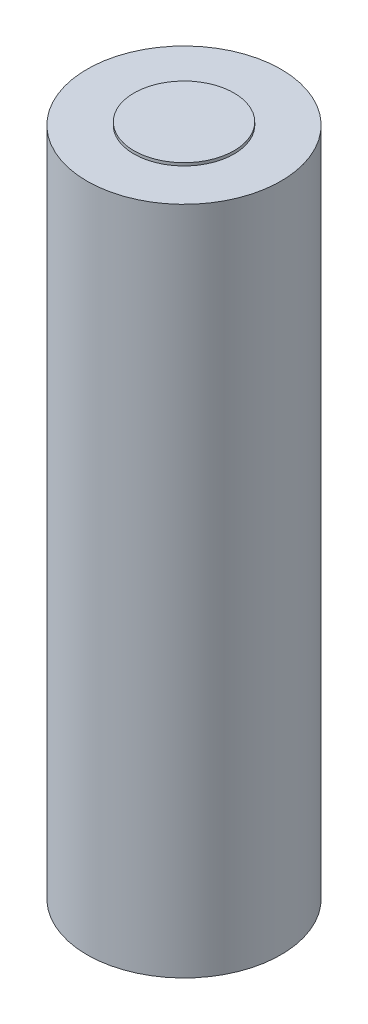
ISO-10303-21;
HEADER;
FILE_DESCRIPTION(('STEP AP214'),'2;1');
FILE_NAME('part.step','',(''),(''),'','','');
FILE_SCHEMA(('AUTOMOTIVE_DESIGN { 1 0 10303 214 1 1 1 1 }'));
ENDSEC;
DATA;
#1=APPLICATION_CONTEXT('core data for automotive mechanical design processes');
#2=APPLICATION_PROTOCOL_DEFINITION('international standard','automotive_design',2000,#1);
#3=PRODUCT_CONTEXT('',#1,'mechanical');
#4=PRODUCT('Part','Part','',(#3));
#5=PRODUCT_RELATED_PRODUCT_CATEGORY('part','',(#4));
#6=PRODUCT_DEFINITION_FORMATION('','',#4);
#7=PRODUCT_DEFINITION_CONTEXT('part definition',#1,'design');
#8=PRODUCT_DEFINITION('design','',#6,#7);
#9=PRODUCT_DEFINITION_SHAPE('','',#8);
#10=(LENGTH_UNIT() NAMED_UNIT(*) SI_UNIT(.MILLI.,.METRE.));
#11=(NAMED_UNIT(*) PLANE_ANGLE_UNIT() SI_UNIT($,.RADIAN.));
#12=(NAMED_UNIT(*) SI_UNIT($,.STERADIAN.) SOLID_ANGLE_UNIT());
#13=UNCERTAINTY_MEASURE_WITH_UNIT(LENGTH_MEASURE(1.E-05),#10,'distance_accuracy_value','');
#14=(GEOMETRIC_REPRESENTATION_CONTEXT(3) GLOBAL_UNCERTAINTY_ASSIGNED_CONTEXT((#13)) GLOBAL_UNIT_ASSIGNED_CONTEXT((#10,
#11,#12)) REPRESENTATION_CONTEXT('',''));
#15=CARTESIAN_POINT('',(0.,0.,0.));
#16=DIRECTION('',(0.,0.,1.));
#17=DIRECTION('',(1.,0.,0.));
#18=AXIS2_PLACEMENT_3D('',#15,#16,#17);
#19=CARTESIAN_POINT('',(0.,70.3,0.));
#20=DIRECTION('',(0.,-1.,0.));
#21=DIRECTION('',(0.,0.,-1.));
#22=AXIS2_PLACEMENT_3D('',#19,#20,#21);
#23=CYLINDRICAL_SURFACE('',#22,10.175);
#24=CARTESIAN_POINT('',(0.,70.3,0.));
#25=DIRECTION('',(0.,1.,0.));
#26=DIRECTION('',(0.,0.,1.));
#27=AXIS2_PLACEMENT_3D('',#24,#25,#26);
#28=CIRCLE('',#27,10.175);
#29=CARTESIAN_POINT('',(0.,70.3,10.175));
#30=VERTEX_POINT('',#29);
#31=EDGE_CURVE('E51',#30,#30,#28,.T.);
#32=ORIENTED_EDGE('',*,*,#31,.F.);
#33=EDGE_LOOP('',(#32));
#34=FACE_BOUND('',#33,.T.);
#35=CARTESIAN_POINT('',(0.,0.,0.));
#36=DIRECTION('',(0.,1.,0.));
#37=DIRECTION('',(0.,0.,1.));
#38=AXIS2_PLACEMENT_3D('',#35,#36,#37);
#39=CIRCLE('',#38,10.175);
#40=CARTESIAN_POINT('',(0.,0.,10.175));
#41=VERTEX_POINT('',#40);
#42=EDGE_CURVE('E47',#41,#41,#39,.T.);
#43=ORIENTED_EDGE('',*,*,#42,.T.);
#44=EDGE_LOOP('',(#43));
#45=FACE_BOUND('',#44,.T.);
#46=ADVANCED_FACE('F44',(#34,#45),#23,.T.);
#47=CARTESIAN_POINT('',(0.,70.3,0.));
#48=DIRECTION('',(0.,1.,0.));
#49=DIRECTION('',(0.,0.,1.));
#50=AXIS2_PLACEMENT_3D('',#47,#48,#49);
#51=PLANE('',#50);
#52=CARTESIAN_POINT('',(0.,70.3,0.));
#53=DIRECTION('',(0.,1.,0.));
#54=DIRECTION('',(0.,0.,1.));
#55=AXIS2_PLACEMENT_3D('',#52,#53,#54);
#56=CIRCLE('',#55,5.25);
#57=CARTESIAN_POINT('',(0.,70.3,5.25));
#58=VERTEX_POINT('',#57);
#59=EDGE_CURVE('E12',#58,#58,#56,.T.);
#60=ORIENTED_EDGE('',*,*,#59,.F.);
#61=EDGE_LOOP('',(#60));
#62=FACE_BOUND('',#61,.T.);
#63=ORIENTED_EDGE('',*,*,#31,.T.);
#64=EDGE_LOOP('',(#63));
#65=FACE_BOUND('',#64,.T.);
#66=ADVANCED_FACE('F68',(#62,#65),#51,.T.);
#67=CARTESIAN_POINT('',(0.,0.,0.));
#68=DIRECTION('',(0.,1.,0.));
#69=DIRECTION('',(0.,0.,1.));
#70=AXIS2_PLACEMENT_3D('',#67,#68,#69);
#71=PLANE('',#70);
#72=ORIENTED_EDGE('',*,*,#42,.F.);
#73=EDGE_LOOP('',(#72));
#74=FACE_BOUND('',#73,.T.);
#75=ADVANCED_FACE('F65',(#74),#71,.F.);
#76=CARTESIAN_POINT('',(0.,70.6,0.));
#77=DIRECTION('',(0.,-1.,0.));
#78=DIRECTION('',(0.,0.,-1.));
#79=AXIS2_PLACEMENT_3D('',#76,#77,#78);
#80=CYLINDRICAL_SURFACE('',#79,5.25);
#81=CARTESIAN_POINT('',(0.,70.6,0.));
#82=DIRECTION('',(0.,1.,0.));
#83=DIRECTION('',(0.,0.,1.));
#84=AXIS2_PLACEMENT_3D('',#81,#82,#83);
#85=CIRCLE('',#84,5.25);
#86=CARTESIAN_POINT('',(0.,70.6,5.25));
#87=VERTEX_POINT('',#86);
#88=EDGE_CURVE('E57',#87,#87,#85,.T.);
#89=ORIENTED_EDGE('',*,*,#88,.F.);
#90=EDGE_LOOP('',(#89));
#91=FACE_BOUND('',#90,.T.);
#92=ORIENTED_EDGE('',*,*,#59,.T.);
#93=EDGE_LOOP('',(#92));
#94=FACE_BOUND('',#93,.T.);
#95=ADVANCED_FACE('F67',(#91,#94),#80,.T.);
#96=CARTESIAN_POINT('',(0.,70.6,0.));
#97=DIRECTION('',(0.,1.,0.));
#98=DIRECTION('',(0.,0.,1.));
#99=AXIS2_PLACEMENT_3D('',#96,#97,#98);
#100=PLANE('',#99);
#101=ORIENTED_EDGE('',*,*,#88,.T.);
#102=EDGE_LOOP('',(#101));
#103=FACE_BOUND('',#102,.T.);
#104=ADVANCED_FACE('F73',(#103),#100,.T.);
#105=CLOSED_SHELL('',(#46,#66,#75,#95,#104));
#106=MANIFOLD_SOLID_BREP('B2',#105);
#107=ADVANCED_BREP_SHAPE_REPRESENTATION('',(#18,#106),#14);
#108=SHAPE_DEFINITION_REPRESENTATION(#9,#107);
ENDSEC;
END-ISO-10303-21;
